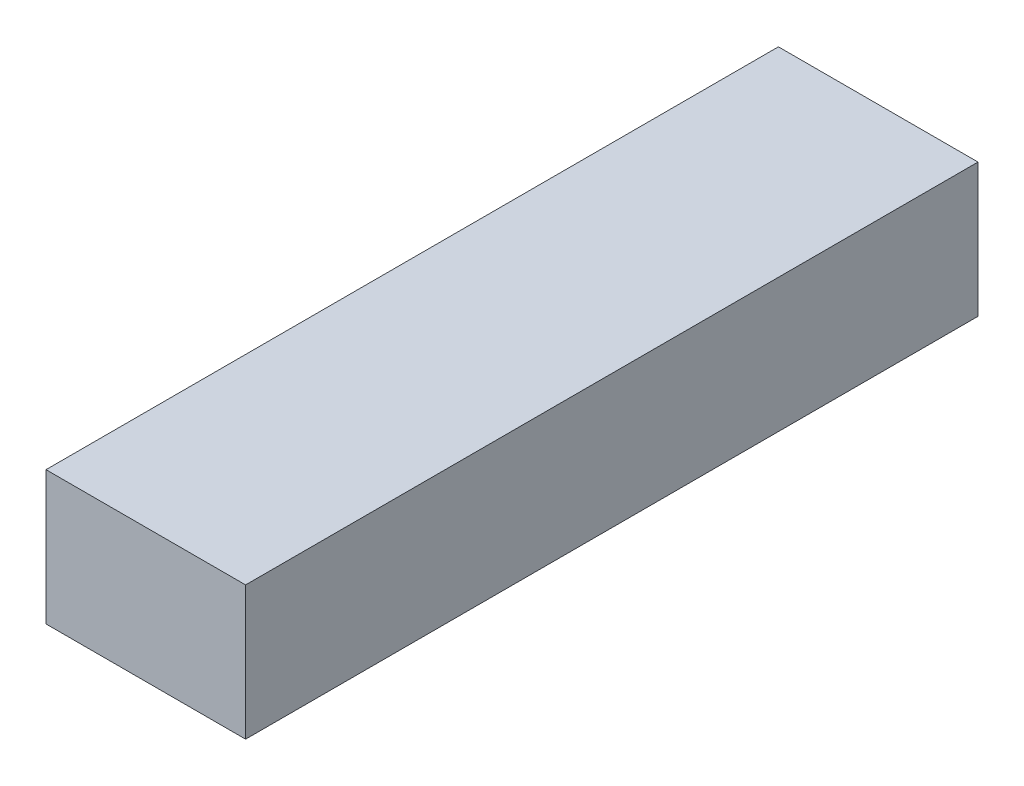
ISO-10303-21;
HEADER;
FILE_DESCRIPTION(('STEP AP214'),'2;1');
FILE_NAME('part.step','',(''),(''),'','','');
FILE_SCHEMA(('AUTOMOTIVE_DESIGN { 1 0 10303 214 1 1 1 1 }'));
ENDSEC;
DATA;
#1=APPLICATION_CONTEXT('core data for automotive mechanical design processes');
#2=APPLICATION_PROTOCOL_DEFINITION('international standard','automotive_design',2000,#1);
#3=PRODUCT_CONTEXT('',#1,'mechanical');
#4=PRODUCT('Part','Part','',(#3));
#5=PRODUCT_RELATED_PRODUCT_CATEGORY('part','',(#4));
#6=PRODUCT_DEFINITION_FORMATION('','',#4);
#7=PRODUCT_DEFINITION_CONTEXT('part definition',#1,'design');
#8=PRODUCT_DEFINITION('design','',#6,#7);
#9=PRODUCT_DEFINITION_SHAPE('','',#8);
#10=(LENGTH_UNIT() NAMED_UNIT(*) SI_UNIT(.MILLI.,.METRE.));
#11=(NAMED_UNIT(*) PLANE_ANGLE_UNIT() SI_UNIT($,.RADIAN.));
#12=(NAMED_UNIT(*) SI_UNIT($,.STERADIAN.) SOLID_ANGLE_UNIT());
#13=UNCERTAINTY_MEASURE_WITH_UNIT(LENGTH_MEASURE(1.E-05),#10,'distance_accuracy_value','');
#14=(GEOMETRIC_REPRESENTATION_CONTEXT(3) GLOBAL_UNCERTAINTY_ASSIGNED_CONTEXT((#13)) GLOBAL_UNIT_ASSIGNED_CONTEXT((#10,
#11,#12)) REPRESENTATION_CONTEXT('',''));
#15=CARTESIAN_POINT('',(0.,0.,0.));
#16=DIRECTION('',(0.,0.,1.));
#17=DIRECTION('',(1.,0.,0.));
#18=AXIS2_PLACEMENT_3D('',#15,#16,#17);
#19=CARTESIAN_POINT('',(14.986,20.066,54.991));
#20=DIRECTION('',(-1.,0.,0.));
#21=DIRECTION('',(0.,0.,1.));
#22=AXIS2_PLACEMENT_3D('',#19,#20,#21);
#23=PLANE('',#22);
#24=DIRECTION('',(0.,0.,-1.));
#25=VECTOR('',#24,1.);
#26=CARTESIAN_POINT('',(14.986,0.,54.991));
#27=LINE('',#26,#25);
#28=CARTESIAN_POINT('',(14.986,0.,54.991));
#29=VERTEX_POINT('',#28);
#30=CARTESIAN_POINT('',(14.986,0.,-54.991));
#31=VERTEX_POINT('',#30);
#32=EDGE_CURVE('E113',#29,#31,#27,.T.);
#33=ORIENTED_EDGE('',*,*,#32,.T.);
#34=DIRECTION('',(0.,-1.,0.));
#35=VECTOR('',#34,1.);
#36=CARTESIAN_POINT('',(14.986,20.066,-54.991));
#37=LINE('',#36,#35);
#38=CARTESIAN_POINT('',(14.986,20.066,-54.991));
#39=VERTEX_POINT('',#38);
#40=EDGE_CURVE('E11',#39,#31,#37,.T.);
#41=ORIENTED_EDGE('',*,*,#40,.F.);
#42=DIRECTION('',(0.,0.,-1.));
#43=VECTOR('',#42,1.);
#44=CARTESIAN_POINT('',(14.986,20.066,54.991));
#45=LINE('',#44,#43);
#46=CARTESIAN_POINT('',(14.986,20.066,54.991));
#47=VERTEX_POINT('',#46);
#48=EDGE_CURVE('E97',#47,#39,#45,.T.);
#49=ORIENTED_EDGE('',*,*,#48,.F.);
#50=DIRECTION('',(0.,-1.,0.));
#51=VECTOR('',#50,1.);
#52=CARTESIAN_POINT('',(14.986,20.066,54.991));
#53=LINE('',#52,#51);
#54=EDGE_CURVE('E109',#47,#29,#53,.T.);
#55=ORIENTED_EDGE('',*,*,#54,.T.);
#56=EDGE_LOOP('',(#33,#41,#49,#55));
#57=FACE_BOUND('',#56,.T.);
#58=ADVANCED_FACE('F45',(#57),#23,.F.);
#59=CARTESIAN_POINT('',(-14.986,20.066,-54.991));
#60=DIRECTION('',(0.,0.,1.));
#61=DIRECTION('',(1.,0.,0.));
#62=AXIS2_PLACEMENT_3D('',#59,#60,#61);
#63=PLANE('',#62);
#64=DIRECTION('',(-1.,0.,0.));
#65=VECTOR('',#64,1.);
#66=CARTESIAN_POINT('',(-14.986,0.,-54.991));
#67=LINE('',#66,#65);
#68=CARTESIAN_POINT('',(-14.986,0.,-54.991));
#69=VERTEX_POINT('',#68);
#70=EDGE_CURVE('E102',#31,#69,#67,.T.);
#71=ORIENTED_EDGE('',*,*,#70,.T.);
#72=DIRECTION('',(0.,-1.,0.));
#73=VECTOR('',#72,1.);
#74=CARTESIAN_POINT('',(-14.986,20.066,-54.991));
#75=LINE('',#74,#73);
#76=CARTESIAN_POINT('',(-14.986,20.066,-54.991));
#77=VERTEX_POINT('',#76);
#78=EDGE_CURVE('E54',#77,#69,#75,.T.);
#79=ORIENTED_EDGE('',*,*,#78,.F.);
#80=DIRECTION('',(-1.,0.,0.));
#81=VECTOR('',#80,1.);
#82=CARTESIAN_POINT('',(-14.986,20.066,-54.991));
#83=LINE('',#82,#81);
#84=EDGE_CURVE('E92',#39,#77,#83,.T.);
#85=ORIENTED_EDGE('',*,*,#84,.F.);
#86=ORIENTED_EDGE('',*,*,#40,.T.);
#87=EDGE_LOOP('',(#71,#79,#85,#86));
#88=FACE_BOUND('',#87,.T.);
#89=ADVANCED_FACE('F101',(#88),#63,.F.);
#90=CARTESIAN_POINT('',(-14.986,20.066,54.991));
#91=DIRECTION('',(1.,0.,0.));
#92=DIRECTION('',(0.,0.,-1.));
#93=AXIS2_PLACEMENT_3D('',#90,#91,#92);
#94=PLANE('',#93);
#95=DIRECTION('',(0.,0.,1.));
#96=VECTOR('',#95,1.);
#97=CARTESIAN_POINT('',(-14.986,0.,54.991));
#98=LINE('',#97,#96);
#99=CARTESIAN_POINT('',(-14.986,0.,54.991));
#100=VERTEX_POINT('',#99);
#101=EDGE_CURVE('E79',#69,#100,#98,.T.);
#102=ORIENTED_EDGE('',*,*,#101,.T.);
#103=DIRECTION('',(0.,-1.,0.));
#104=VECTOR('',#103,1.);
#105=CARTESIAN_POINT('',(-14.986,20.066,54.991));
#106=LINE('',#105,#104);
#107=CARTESIAN_POINT('',(-14.986,20.066,54.991));
#108=VERTEX_POINT('',#107);
#109=EDGE_CURVE('E104',#108,#100,#106,.T.);
#110=ORIENTED_EDGE('',*,*,#109,.F.);
#111=DIRECTION('',(0.,0.,1.));
#112=VECTOR('',#111,1.);
#113=CARTESIAN_POINT('',(-14.986,20.066,54.991));
#114=LINE('',#113,#112);
#115=EDGE_CURVE('E95',#77,#108,#114,.T.);
#116=ORIENTED_EDGE('',*,*,#115,.F.);
#117=ORIENTED_EDGE('',*,*,#78,.T.);
#118=EDGE_LOOP('',(#102,#110,#116,#117));
#119=FACE_BOUND('',#118,.T.);
#120=ADVANCED_FACE('F105',(#119),#94,.F.);
#121=CARTESIAN_POINT('',(-14.986,20.066,54.991));
#122=DIRECTION('',(0.,0.,-1.));
#123=DIRECTION('',(-1.,0.,0.));
#124=AXIS2_PLACEMENT_3D('',#121,#122,#123);
#125=PLANE('',#124);
#126=DIRECTION('',(1.,0.,0.));
#127=VECTOR('',#126,1.);
#128=CARTESIAN_POINT('',(-14.986,0.,54.991));
#129=LINE('',#128,#127);
#130=EDGE_CURVE('E85',#100,#29,#129,.T.);
#131=ORIENTED_EDGE('',*,*,#130,.T.);
#132=ORIENTED_EDGE('',*,*,#54,.F.);
#133=DIRECTION('',(1.,0.,0.));
#134=VECTOR('',#133,1.);
#135=CARTESIAN_POINT('',(-14.986,20.066,54.991));
#136=LINE('',#135,#134);
#137=EDGE_CURVE('E62',#108,#47,#136,.T.);
#138=ORIENTED_EDGE('',*,*,#137,.F.);
#139=ORIENTED_EDGE('',*,*,#109,.T.);
#140=EDGE_LOOP('',(#131,#132,#138,#139));
#141=FACE_BOUND('',#140,.T.);
#142=ADVANCED_FACE('F126',(#141),#125,.F.);
#143=CARTESIAN_POINT('',(0.,20.066,0.));
#144=DIRECTION('',(0.,-1.,0.));
#145=DIRECTION('',(0.,0.,-1.));
#146=AXIS2_PLACEMENT_3D('',#143,#144,#145);
#147=PLANE('',#146);
#148=ORIENTED_EDGE('',*,*,#48,.T.);
#149=ORIENTED_EDGE('',*,*,#84,.T.);
#150=ORIENTED_EDGE('',*,*,#115,.T.);
#151=ORIENTED_EDGE('',*,*,#137,.T.);
#152=EDGE_LOOP('',(#148,#149,#150,#151));
#153=FACE_BOUND('',#152,.T.);
#154=ADVANCED_FACE('F93',(#153),#147,.F.);
#155=CARTESIAN_POINT('',(0.,0.,0.));
#156=DIRECTION('',(0.,-1.,0.));
#157=DIRECTION('',(0.,0.,-1.));
#158=AXIS2_PLACEMENT_3D('',#155,#156,#157);
#159=PLANE('',#158);
#160=ORIENTED_EDGE('',*,*,#32,.F.);
#161=ORIENTED_EDGE('',*,*,#130,.F.);
#162=ORIENTED_EDGE('',*,*,#101,.F.);
#163=ORIENTED_EDGE('',*,*,#70,.F.);
#164=EDGE_LOOP('',(#160,#161,#162,#163));
#165=FACE_BOUND('',#164,.T.);
#166=ADVANCED_FACE('F129',(#165),#159,.T.);
#167=CLOSED_SHELL('',(#58,#89,#120,#142,#154,#166));
#168=MANIFOLD_SOLID_BREP('B2',#167);
#169=ADVANCED_BREP_SHAPE_REPRESENTATION('',(#18,#168),#14);
#170=SHAPE_DEFINITION_REPRESENTATION(#9,#169);
ENDSEC;
END-ISO-10303-21;
